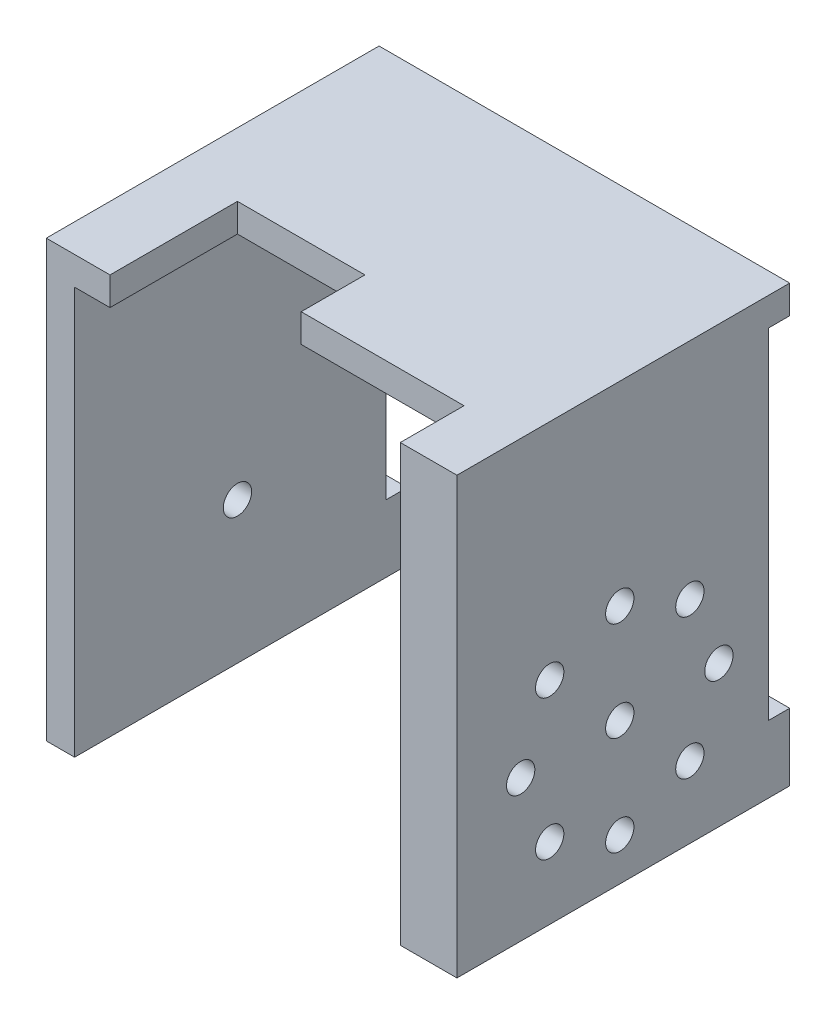
ISO-10303-21;
HEADER;
FILE_DESCRIPTION(('STEP AP214'),'2;1');
FILE_NAME('part.step','',(''),(''),'','','');
FILE_SCHEMA(('AUTOMOTIVE_DESIGN { 1 0 10303 214 1 1 1 1 }'));
ENDSEC;
DATA;
#1=APPLICATION_CONTEXT('core data for automotive mechanical design processes');
#2=APPLICATION_PROTOCOL_DEFINITION('international standard','automotive_design',2000,#1);
#3=PRODUCT_CONTEXT('',#1,'mechanical');
#4=PRODUCT('Part','Part','',(#3));
#5=PRODUCT_RELATED_PRODUCT_CATEGORY('part','',(#4));
#6=PRODUCT_DEFINITION_FORMATION('','',#4);
#7=PRODUCT_DEFINITION_CONTEXT('part definition',#1,'design');
#8=PRODUCT_DEFINITION('design','',#6,#7);
#9=PRODUCT_DEFINITION_SHAPE('','',#8);
#10=(LENGTH_UNIT() NAMED_UNIT(*) SI_UNIT(.MILLI.,.METRE.));
#11=(NAMED_UNIT(*) PLANE_ANGLE_UNIT() SI_UNIT($,.RADIAN.));
#12=(NAMED_UNIT(*) SI_UNIT($,.STERADIAN.) SOLID_ANGLE_UNIT());
#13=UNCERTAINTY_MEASURE_WITH_UNIT(LENGTH_MEASURE(1.E-05),#10,'distance_accuracy_value','');
#14=(GEOMETRIC_REPRESENTATION_CONTEXT(3) GLOBAL_UNCERTAINTY_ASSIGNED_CONTEXT((#13)) GLOBAL_UNIT_ASSIGNED_CONTEXT((#10,
#11,#12)) REPRESENTATION_CONTEXT('',''));
#15=CARTESIAN_POINT('',(0.,0.,0.));
#16=DIRECTION('',(0.,0.,1.));
#17=DIRECTION('',(1.,0.,0.));
#18=AXIS2_PLACEMENT_3D('',#15,#16,#17);
#19=CARTESIAN_POINT('',(46.,37.5,47.));
#20=DIRECTION('',(0.,0.,-1.));
#21=DIRECTION('',(-1.,0.,0.));
#22=AXIS2_PLACEMENT_3D('',#19,#20,#21);
#23=PLANE('',#22);
#24=DIRECTION('',(-1.,0.,0.));
#25=VECTOR('',#24,1.);
#26=CARTESIAN_POINT('',(-4.,41.5,47.));
#27=LINE('',#26,#25);
#28=CARTESIAN_POINT('',(54.,41.5,47.));
#29=VERTEX_POINT('',#28);
#30=CARTESIAN_POINT('',(46.0000000000002,41.5,47.));
#31=VERTEX_POINT('',#30);
#32=EDGE_CURVE('E311',#29,#31,#27,.T.);
#33=ORIENTED_EDGE('',*,*,#32,.T.);
#34=DIRECTION('',(0.,-1.,0.));
#35=VECTOR('',#34,1.);
#36=CARTESIAN_POINT('',(46.,37.5,47.));
#37=LINE('',#36,#35);
#38=CARTESIAN_POINT('',(46.0000000000002,-20.,47.));
#39=VERTEX_POINT('',#38);
#40=EDGE_CURVE('E304',#31,#39,#37,.T.);
#41=ORIENTED_EDGE('',*,*,#40,.T.);
#42=DIRECTION('',(1.,0.,0.));
#43=VECTOR('',#42,1.);
#44=CARTESIAN_POINT('',(46.0000000000002,-20.,47.));
#45=LINE('',#44,#43);
#46=CARTESIAN_POINT('',(54.0000000000002,-20.,47.));
#47=VERTEX_POINT('',#46);
#48=EDGE_CURVE('E307',#39,#47,#45,.T.);
#49=ORIENTED_EDGE('',*,*,#48,.T.);
#50=DIRECTION('',(0.,1.,0.));
#51=VECTOR('',#50,1.);
#52=CARTESIAN_POINT('',(54.,41.5,47.));
#53=LINE('',#52,#51);
#54=EDGE_CURVE('E309',#47,#29,#53,.T.);
#55=ORIENTED_EDGE('',*,*,#54,.T.);
#56=EDGE_LOOP('',(#33,#41,#49,#55));
#57=FACE_BOUND('',#56,.T.);
#58=ADVANCED_FACE('F30',(#57),#23,.F.);
#59=CARTESIAN_POINT('',(46.,37.5,0.));
#60=DIRECTION('',(0.,0.,-1.));
#61=DIRECTION('',(-1.,0.,0.));
#62=AXIS2_PLACEMENT_3D('',#59,#60,#61);
#63=PLANE('',#62);
#64=DIRECTION('',(1.,0.,0.));
#65=VECTOR('',#64,1.);
#66=CARTESIAN_POINT('',(-4.00000000000005,-10.5000000000002,0.));
#67=LINE('',#66,#65);
#68=CARTESIAN_POINT('',(-4.00000000000005,-10.5000000000002,0.));
#69=VERTEX_POINT('',#68);
#70=CARTESIAN_POINT('',(0.,-10.5000000000002,0.));
#71=VERTEX_POINT('',#70);
#72=EDGE_CURVE('E283',#69,#71,#67,.T.);
#73=ORIENTED_EDGE('',*,*,#72,.T.);
#74=DIRECTION('',(0.,1.,0.));
#75=VECTOR('',#74,1.);
#76=CARTESIAN_POINT('',(0.,-20.,0.));
#77=LINE('',#76,#75);
#78=CARTESIAN_POINT('',(0.,-20.,0.));
#79=VERTEX_POINT('',#78);
#80=EDGE_CURVE('E305',#79,#71,#77,.T.);
#81=ORIENTED_EDGE('',*,*,#80,.F.);
#82=DIRECTION('',(1.,0.,0.));
#83=VECTOR('',#82,1.);
#84=CARTESIAN_POINT('',(0.,-20.,0.));
#85=LINE('',#84,#83);
#86=CARTESIAN_POINT('',(-4.00000000000001,-20.,0.));
#87=VERTEX_POINT('',#86);
#88=EDGE_CURVE('E336',#87,#79,#85,.T.);
#89=ORIENTED_EDGE('',*,*,#88,.F.);
#90=DIRECTION('',(0.,-1.,0.));
#91=VECTOR('',#90,1.);
#92=CARTESIAN_POINT('',(-4.00000000000001,-20.,0.));
#93=LINE('',#92,#91);
#94=EDGE_CURVE('E332',#69,#87,#93,.T.);
#95=ORIENTED_EDGE('',*,*,#94,.F.);
#96=EDGE_LOOP('',(#73,#81,#89,#95));
#97=FACE_BOUND('',#96,.T.);
#98=ADVANCED_FACE('F422',(#97),#63,.T.);
#99=DIRECTION('',(-1.,0.,0.));
#100=VECTOR('',#99,1.);
#101=CARTESIAN_POINT('',(46.0000000000002,-10.5,0.));
#102=LINE('',#101,#100);
#103=CARTESIAN_POINT('',(54.0000000000002,-10.5,0.));
#104=VERTEX_POINT('',#103);
#105=CARTESIAN_POINT('',(46.0000000000001,-10.5,0.));
#106=VERTEX_POINT('',#105);
#107=EDGE_CURVE('E39',#104,#106,#102,.T.);
#108=ORIENTED_EDGE('',*,*,#107,.F.);
#109=DIRECTION('',(0.,1.,0.));
#110=VECTOR('',#109,1.);
#111=CARTESIAN_POINT('',(54.,41.5,0.));
#112=LINE('',#111,#110);
#113=CARTESIAN_POINT('',(54.0000000000002,-20.,0.));
#114=VERTEX_POINT('',#113);
#115=EDGE_CURVE('E327',#114,#104,#112,.T.);
#116=ORIENTED_EDGE('',*,*,#115,.F.);
#117=DIRECTION('',(1.,0.,0.));
#118=VECTOR('',#117,1.);
#119=CARTESIAN_POINT('',(46.0000000000002,-20.,0.));
#120=LINE('',#119,#118);
#121=CARTESIAN_POINT('',(46.0000000000002,-20.,0.));
#122=VERTEX_POINT('',#121);
#123=EDGE_CURVE('E324',#122,#114,#120,.T.);
#124=ORIENTED_EDGE('',*,*,#123,.F.);
#125=DIRECTION('',(0.,-1.,0.));
#126=VECTOR('',#125,1.);
#127=CARTESIAN_POINT('',(46.,37.5,0.));
#128=LINE('',#127,#126);
#129=EDGE_CURVE('E322',#106,#122,#128,.T.);
#130=ORIENTED_EDGE('',*,*,#129,.F.);
#131=EDGE_LOOP('',(#108,#116,#124,#130));
#132=FACE_BOUND('',#131,.T.);
#133=ADVANCED_FACE('F375',(#132),#63,.T.);
#134=CARTESIAN_POINT('',(0.,37.5,47.));
#135=DIRECTION('',(0.,1.,0.));
#136=DIRECTION('',(-1.,0.,0.));
#137=AXIS2_PLACEMENT_3D('',#134,#135,#136);
#138=PLANE('',#137);
#139=DIRECTION('',(0.,0.,-1.));
#140=VECTOR('',#139,1.);
#141=CARTESIAN_POINT('',(46.,37.5,47.));
#142=LINE('',#141,#140);
#143=CARTESIAN_POINT('',(46.,37.5,38.));
#144=VERTEX_POINT('',#143);
#145=CARTESIAN_POINT('',(46.,37.5,3.00000000000001));
#146=VERTEX_POINT('',#145);
#147=EDGE_CURVE('E360',#144,#146,#142,.T.);
#148=ORIENTED_EDGE('',*,*,#147,.F.);
#149=DIRECTION('',(1.,0.,0.));
#150=VECTOR('',#149,1.);
#151=CARTESIAN_POINT('',(23.,37.5,38.));
#152=LINE('',#151,#150);
#153=CARTESIAN_POINT('',(23.,37.5,38.));
#154=VERTEX_POINT('',#153);
#155=EDGE_CURVE('E185',#154,#144,#152,.T.);
#156=ORIENTED_EDGE('',*,*,#155,.F.);
#157=DIRECTION('',(0.,0.,1.));
#158=VECTOR('',#157,1.);
#159=CARTESIAN_POINT('',(23.,37.5,38.));
#160=LINE('',#159,#158);
#161=CARTESIAN_POINT('',(23.,37.5,29.));
#162=VERTEX_POINT('',#161);
#163=EDGE_CURVE('E188',#162,#154,#160,.T.);
#164=ORIENTED_EDGE('',*,*,#163,.F.);
#165=DIRECTION('',(1.,0.,0.));
#166=VECTOR('',#165,1.);
#167=CARTESIAN_POINT('',(5.00000000000004,37.5,29.));
#168=LINE('',#167,#166);
#169=CARTESIAN_POINT('',(5.00000000000004,37.5,29.));
#170=VERTEX_POINT('',#169);
#171=EDGE_CURVE('E198',#170,#162,#168,.T.);
#172=ORIENTED_EDGE('',*,*,#171,.F.);
#173=DIRECTION('',(0.,0.,-1.));
#174=VECTOR('',#173,1.);
#175=CARTESIAN_POINT('',(5.00000000000003,37.5,47.));
#176=LINE('',#175,#174);
#177=CARTESIAN_POINT('',(5.00000000000003,37.5,47.));
#178=VERTEX_POINT('',#177);
#179=EDGE_CURVE('E165',#178,#170,#176,.T.);
#180=ORIENTED_EDGE('',*,*,#179,.F.);
#181=DIRECTION('',(1.,0.,0.));
#182=VECTOR('',#181,1.);
#183=CARTESIAN_POINT('',(0.,37.5,47.));
#184=LINE('',#183,#182);
#185=CARTESIAN_POINT('',(0.,37.5,47.));
#186=VERTEX_POINT('',#185);
#187=EDGE_CURVE('E301',#186,#178,#184,.T.);
#188=ORIENTED_EDGE('',*,*,#187,.F.);
#189=DIRECTION('',(0.,0.,-1.));
#190=VECTOR('',#189,1.);
#191=CARTESIAN_POINT('',(0.,37.5,47.));
#192=LINE('',#191,#190);
#193=CARTESIAN_POINT('',(0.,37.4999999999998,3.00000000000001));
#194=VERTEX_POINT('',#193);
#195=EDGE_CURVE('E320',#186,#194,#192,.T.);
#196=ORIENTED_EDGE('',*,*,#195,.T.);
#197=DIRECTION('',(1.,0.,0.));
#198=VECTOR('',#197,1.);
#199=CARTESIAN_POINT('',(-4.00000000000021,37.4999999999998,3.00000000000001));
#200=LINE('',#199,#198);
#201=CARTESIAN_POINT('',(-4.00000000000021,37.4999999999998,3.00000000000001));
#202=VERTEX_POINT('',#201);
#203=EDGE_CURVE('E291',#202,#194,#200,.T.);
#204=ORIENTED_EDGE('',*,*,#203,.F.);
#205=DIRECTION('',(0.,0.,1.));
#206=VECTOR('',#205,1.);
#207=CARTESIAN_POINT('',(-4.00000000000021,37.4999999999998,0.));
#208=LINE('',#207,#206);
#209=CARTESIAN_POINT('',(-4.,37.4999999999998,0.));
#210=VERTEX_POINT('',#209);
#211=EDGE_CURVE('E266',#210,#202,#208,.T.);
#212=ORIENTED_EDGE('',*,*,#211,.F.);
#213=DIRECTION('',(1.,0.,0.));
#214=VECTOR('',#213,1.);
#215=CARTESIAN_POINT('',(0.,37.5,0.));
#216=LINE('',#215,#214);
#217=CARTESIAN_POINT('',(54.,37.5,0.));
#218=VERTEX_POINT('',#217);
#219=EDGE_CURVE('E54',#210,#218,#216,.T.);
#220=ORIENTED_EDGE('',*,*,#219,.T.);
#221=DIRECTION('',(0.,0.,1.));
#222=VECTOR('',#221,1.);
#223=CARTESIAN_POINT('',(54.,37.5,0.));
#224=LINE('',#223,#222);
#225=CARTESIAN_POINT('',(54.,37.5,3.00000000000001));
#226=VERTEX_POINT('',#225);
#227=EDGE_CURVE('E265',#218,#226,#224,.T.);
#228=ORIENTED_EDGE('',*,*,#227,.T.);
#229=EDGE_CURVE('E276',#146,#226,#200,.T.);
#230=ORIENTED_EDGE('',*,*,#229,.F.);
#231=EDGE_LOOP('',(#148,#156,#164,#172,#180,#188,#196,#204,#212,#220,#228,#230));
#232=FACE_BOUND('',#231,.T.);
#233=ADVANCED_FACE('F32',(#232),#138,.F.);
#234=CARTESIAN_POINT('',(46.,37.5,47.));
#235=DIRECTION('',(1.,0.,0.));
#236=DIRECTION('',(0.,1.,0.));
#237=AXIS2_PLACEMENT_3D('',#234,#235,#236);
#238=PLANE('',#237);
#239=CARTESIAN_POINT('',(46.0000000000001,9.89949493661152,33.899494936612));
#240=DIRECTION('',(1.,0.,0.));
#241=DIRECTION('',(0.,1.,0.));
#242=AXIS2_PLACEMENT_3D('',#239,#240,#241);
#243=CIRCLE('',#242,2.00000000000028);
#244=CARTESIAN_POINT('',(46.0000000000001,11.8994949366118,33.899494936612));
#245=VERTEX_POINT('',#244);
#246=EDGE_CURVE('E209',#245,#245,#243,.F.);
#247=ORIENTED_EDGE('',*,*,#246,.F.);
#248=EDGE_LOOP('',(#247));
#249=FACE_BOUND('',#248,.T.);
#250=CARTESIAN_POINT('',(46.0000000000001,-1.07975958797385E-13,37.9999999999998));
#251=DIRECTION('',(1.,0.,0.));
#252=DIRECTION('',(0.,1.,0.));
#253=AXIS2_PLACEMENT_3D('',#250,#251,#252);
#254=CIRCLE('',#253,2.);
#255=CARTESIAN_POINT('',(46.0000000000001,1.99999999999989,37.9999999999998));
#256=VERTEX_POINT('',#255);
#257=EDGE_CURVE('E215',#256,#256,#254,.F.);
#258=ORIENTED_EDGE('',*,*,#257,.F.);
#259=EDGE_LOOP('',(#258));
#260=FACE_BOUND('',#259,.T.);
#261=CARTESIAN_POINT('',(46.0000000000002,-9.89949493661177,33.8994949366114));
#262=DIRECTION('',(1.,0.,0.));
#263=DIRECTION('',(0.,1.,0.));
#264=AXIS2_PLACEMENT_3D('',#261,#262,#263);
#265=CIRCLE('',#264,2.);
#266=CARTESIAN_POINT('',(46.0000000000002,-7.89949493661177,33.8994949366114));
#267=VERTEX_POINT('',#266);
#268=EDGE_CURVE('E221',#267,#267,#265,.F.);
#269=ORIENTED_EDGE('',*,*,#268,.F.);
#270=EDGE_LOOP('',(#269));
#271=FACE_BOUND('',#270,.T.);
#272=CARTESIAN_POINT('',(46.0000000000002,-14.0000000000001,23.9999999999997));
#273=DIRECTION('',(1.,0.,0.));
#274=DIRECTION('',(0.,1.,0.));
#275=AXIS2_PLACEMENT_3D('',#272,#273,#274);
#276=CIRCLE('',#275,2.);
#277=CARTESIAN_POINT('',(46.0000000000002,-12.0000000000001,23.9999999999997));
#278=VERTEX_POINT('',#277);
#279=EDGE_CURVE('E227',#278,#278,#276,.F.);
#280=ORIENTED_EDGE('',*,*,#279,.F.);
#281=EDGE_LOOP('',(#280));
#282=FACE_BOUND('',#281,.T.);
#283=CARTESIAN_POINT('',(46.0000000000002,-9.89949493661163,14.1005050633881));
#284=DIRECTION('',(1.,0.,0.));
#285=DIRECTION('',(0.,1.,0.));
#286=AXIS2_PLACEMENT_3D('',#283,#284,#285);
#287=CIRCLE('',#286,2.);
#288=CARTESIAN_POINT('',(46.0000000000002,-7.89949493661163,14.1005050633881));
#289=VERTEX_POINT('',#288);
#290=EDGE_CURVE('E233',#289,#289,#287,.F.);
#291=ORIENTED_EDGE('',*,*,#290,.F.);
#292=EDGE_LOOP('',(#291));
#293=FACE_BOUND('',#292,.T.);
#294=CARTESIAN_POINT('',(46.0000000000001,0.,9.9999999999998));
#295=DIRECTION('',(1.,0.,0.));
#296=DIRECTION('',(0.,1.,0.));
#297=AXIS2_PLACEMENT_3D('',#294,#295,#296);
#298=CIRCLE('',#297,2.);
#299=CARTESIAN_POINT('',(46.0000000000001,2.0000000000001,9.9999999999998));
#300=VERTEX_POINT('',#299);
#301=EDGE_CURVE('E239',#300,#300,#298,.F.);
#302=ORIENTED_EDGE('',*,*,#301,.F.);
#303=EDGE_LOOP('',(#302));
#304=FACE_BOUND('',#303,.T.);
#305=CARTESIAN_POINT('',(46.0000000000001,9.89949493661173,14.1005050633883));
#306=DIRECTION('',(1.,0.,0.));
#307=DIRECTION('',(0.,1.,0.));
#308=AXIS2_PLACEMENT_3D('',#305,#306,#307);
#309=CIRCLE('',#308,2.);
#310=CARTESIAN_POINT('',(46.0000000000001,11.8994949366117,14.1005050633883));
#311=VERTEX_POINT('',#310);
#312=EDGE_CURVE('E245',#311,#311,#309,.F.);
#313=ORIENTED_EDGE('',*,*,#312,.F.);
#314=EDGE_LOOP('',(#313));
#315=FACE_BOUND('',#314,.T.);
#316=CARTESIAN_POINT('',(46.0000000000001,13.9999999999999,24.));
#317=DIRECTION('',(1.,0.,0.));
#318=DIRECTION('',(0.,1.,0.));
#319=AXIS2_PLACEMENT_3D('',#316,#317,#318);
#320=CIRCLE('',#319,2.);
#321=CARTESIAN_POINT('',(46.0000000000001,15.9999999999999,24.));
#322=VERTEX_POINT('',#321);
#323=EDGE_CURVE('E251',#322,#322,#320,.F.);
#324=ORIENTED_EDGE('',*,*,#323,.F.);
#325=EDGE_LOOP('',(#324));
#326=FACE_BOUND('',#325,.T.);
#327=CARTESIAN_POINT('',(46.0000000000001,0.,24.));
#328=DIRECTION('',(1.,0.,0.));
#329=DIRECTION('',(0.,1.,0.));
#330=AXIS2_PLACEMENT_3D('',#327,#328,#329);
#331=CIRCLE('',#330,2.);
#332=CARTESIAN_POINT('',(46.0000000000001,1.99999999999994,24.));
#333=VERTEX_POINT('',#332);
#334=EDGE_CURVE('E262',#333,#333,#331,.T.);
#335=ORIENTED_EDGE('',*,*,#334,.T.);
#336=EDGE_LOOP('',(#335));
#337=FACE_BOUND('',#336,.T.);
#338=DIRECTION('',(0.,-1.,0.));
#339=VECTOR('',#338,1.);
#340=CARTESIAN_POINT('',(46.,37.5,3.));
#341=LINE('',#340,#339);
#342=CARTESIAN_POINT('',(46.0000000000001,-10.5,3.));
#343=VERTEX_POINT('',#342);
#344=EDGE_CURVE('E298',#146,#343,#341,.T.);
#345=ORIENTED_EDGE('',*,*,#344,.T.);
#346=DIRECTION('',(0.,0.,-1.));
#347=VECTOR('',#346,1.);
#348=CARTESIAN_POINT('',(46.0000000000002,-10.5,47.));
#349=LINE('',#348,#347);
#350=EDGE_CURVE('E295',#343,#106,#349,.T.);
#351=ORIENTED_EDGE('',*,*,#350,.T.);
#352=ORIENTED_EDGE('',*,*,#129,.T.);
#353=DIRECTION('',(0.,0.,-1.));
#354=VECTOR('',#353,1.);
#355=CARTESIAN_POINT('',(46.0000000000002,-20.,47.));
#356=LINE('',#355,#354);
#357=EDGE_CURVE('E357',#39,#122,#356,.T.);
#358=ORIENTED_EDGE('',*,*,#357,.F.);
#359=ORIENTED_EDGE('',*,*,#40,.F.);
#360=DIRECTION('',(0.,0.,1.));
#361=VECTOR('',#360,1.);
#362=CARTESIAN_POINT('',(46.,41.5,38.));
#363=LINE('',#362,#361);
#364=CARTESIAN_POINT('',(46.,41.5,38.));
#365=VERTEX_POINT('',#364);
#366=EDGE_CURVE('E194',#365,#31,#363,.T.);
#367=ORIENTED_EDGE('',*,*,#366,.F.);
#368=DIRECTION('',(0.,-1.,0.));
#369=VECTOR('',#368,1.);
#370=CARTESIAN_POINT('',(46.,41.5,38.));
#371=LINE('',#370,#369);
#372=EDGE_CURVE('E202',#365,#144,#371,.T.);
#373=ORIENTED_EDGE('',*,*,#372,.T.);
#374=ORIENTED_EDGE('',*,*,#147,.T.);
#375=EDGE_LOOP('',(#345,#351,#352,#358,#359,#367,#373,#374));
#376=FACE_BOUND('',#375,.T.);
#377=ADVANCED_FACE('F371',(#249,#260,#271,#282,#293,#304,#315,#326,#337,#376),#238,.F.);
#378=CARTESIAN_POINT('',(46.0000000000002,-20.,47.));
#379=DIRECTION('',(0.,1.,0.));
#380=DIRECTION('',(-1.,0.,0.));
#381=AXIS2_PLACEMENT_3D('',#378,#379,#380);
#382=PLANE('',#381);
#383=ORIENTED_EDGE('',*,*,#123,.T.);
#384=DIRECTION('',(0.,0.,-1.));
#385=VECTOR('',#384,1.);
#386=CARTESIAN_POINT('',(54.0000000000002,-20.,47.));
#387=LINE('',#386,#385);
#388=EDGE_CURVE('E354',#47,#114,#387,.T.);
#389=ORIENTED_EDGE('',*,*,#388,.F.);
#390=ORIENTED_EDGE('',*,*,#48,.F.);
#391=ORIENTED_EDGE('',*,*,#357,.T.);
#392=EDGE_LOOP('',(#383,#389,#390,#391));
#393=FACE_BOUND('',#392,.T.);
#394=ADVANCED_FACE('F378',(#393),#382,.F.);
#395=CARTESIAN_POINT('',(54.,41.5,47.));
#396=DIRECTION('',(-1.,0.,0.));
#397=DIRECTION('',(0.,-1.,0.));
#398=AXIS2_PLACEMENT_3D('',#395,#396,#397);
#399=PLANE('',#398);
#400=CARTESIAN_POINT('',(54.0000000000001,9.89949493661154,33.899494936612));
#401=DIRECTION('',(1.,0.,0.));
#402=DIRECTION('',(0.,1.,0.));
#403=AXIS2_PLACEMENT_3D('',#400,#401,#402);
#404=CIRCLE('',#403,2.00000000000028);
#405=CARTESIAN_POINT('',(54.0000000000001,11.8994949366118,33.899494936612));
#406=VERTEX_POINT('',#405);
#407=EDGE_CURVE('E204',#406,#406,#404,.T.);
#408=ORIENTED_EDGE('',*,*,#407,.F.);
#409=EDGE_LOOP('',(#408));
#410=FACE_BOUND('',#409,.T.);
#411=CARTESIAN_POINT('',(54.0000000000001,0.,37.9999999999998));
#412=DIRECTION('',(1.,0.,0.));
#413=DIRECTION('',(0.,1.,0.));
#414=AXIS2_PLACEMENT_3D('',#411,#412,#413);
#415=CIRCLE('',#414,2.);
#416=CARTESIAN_POINT('',(54.0000000000001,1.99999999999992,37.9999999999998));
#417=VERTEX_POINT('',#416);
#418=EDGE_CURVE('E212',#417,#417,#415,.T.);
#419=ORIENTED_EDGE('',*,*,#418,.F.);
#420=EDGE_LOOP('',(#419));
#421=FACE_BOUND('',#420,.T.);
#422=CARTESIAN_POINT('',(54.0000000000002,-9.89949493661175,33.8994949366114));
#423=DIRECTION('',(1.,0.,0.));
#424=DIRECTION('',(0.,1.,0.));
#425=AXIS2_PLACEMENT_3D('',#422,#423,#424);
#426=CIRCLE('',#425,2.);
#427=CARTESIAN_POINT('',(54.0000000000002,-7.89949493661174,33.8994949366114));
#428=VERTEX_POINT('',#427);
#429=EDGE_CURVE('E218',#428,#428,#426,.T.);
#430=ORIENTED_EDGE('',*,*,#429,.F.);
#431=EDGE_LOOP('',(#430));
#432=FACE_BOUND('',#431,.T.);
#433=CARTESIAN_POINT('',(54.0000000000002,-14.,23.9999999999997));
#434=DIRECTION('',(1.,0.,0.));
#435=DIRECTION('',(0.,1.,0.));
#436=AXIS2_PLACEMENT_3D('',#433,#434,#435);
#437=CIRCLE('',#436,2.);
#438=CARTESIAN_POINT('',(54.0000000000002,-12.,23.9999999999997));
#439=VERTEX_POINT('',#438);
#440=EDGE_CURVE('E224',#439,#439,#437,.T.);
#441=ORIENTED_EDGE('',*,*,#440,.F.);
#442=EDGE_LOOP('',(#441));
#443=FACE_BOUND('',#442,.T.);
#444=CARTESIAN_POINT('',(54.0000000000002,-9.89949493661161,14.1005050633881));
#445=DIRECTION('',(1.,0.,0.));
#446=DIRECTION('',(0.,1.,0.));
#447=AXIS2_PLACEMENT_3D('',#444,#445,#446);
#448=CIRCLE('',#447,2.);
#449=CARTESIAN_POINT('',(54.0000000000002,-7.8994949366116,14.1005050633881));
#450=VERTEX_POINT('',#449);
#451=EDGE_CURVE('E230',#450,#450,#448,.T.);
#452=ORIENTED_EDGE('',*,*,#451,.F.);
#453=EDGE_LOOP('',(#452));
#454=FACE_BOUND('',#453,.T.);
#455=CARTESIAN_POINT('',(54.0000000000001,1.20330574772636E-13,9.9999999999998));
#456=DIRECTION('',(1.,0.,0.));
#457=DIRECTION('',(0.,1.,0.));
#458=AXIS2_PLACEMENT_3D('',#455,#456,#457);
#459=CIRCLE('',#458,2.);
#460=CARTESIAN_POINT('',(54.0000000000001,2.00000000000012,9.9999999999998));
#461=VERTEX_POINT('',#460);
#462=EDGE_CURVE('E236',#461,#461,#459,.T.);
#463=ORIENTED_EDGE('',*,*,#462,.F.);
#464=EDGE_LOOP('',(#463));
#465=FACE_BOUND('',#464,.T.);
#466=CARTESIAN_POINT('',(54.0000000000001,9.89949493661176,14.1005050633883));
#467=DIRECTION('',(1.,0.,0.));
#468=DIRECTION('',(0.,1.,0.));
#469=AXIS2_PLACEMENT_3D('',#466,#467,#468);
#470=CIRCLE('',#469,2.);
#471=CARTESIAN_POINT('',(54.0000000000001,11.8994949366118,14.1005050633883));
#472=VERTEX_POINT('',#471);
#473=EDGE_CURVE('E242',#472,#472,#470,.T.);
#474=ORIENTED_EDGE('',*,*,#473,.F.);
#475=EDGE_LOOP('',(#474));
#476=FACE_BOUND('',#475,.T.);
#477=CARTESIAN_POINT('',(54.0000000000001,14.,24.));
#478=DIRECTION('',(1.,0.,0.));
#479=DIRECTION('',(0.,1.,0.));
#480=AXIS2_PLACEMENT_3D('',#477,#478,#479);
#481=CIRCLE('',#480,2.);
#482=CARTESIAN_POINT('',(54.0000000000001,16.,24.));
#483=VERTEX_POINT('',#482);
#484=EDGE_CURVE('E248',#483,#483,#481,.T.);
#485=ORIENTED_EDGE('',*,*,#484,.F.);
#486=EDGE_LOOP('',(#485));
#487=FACE_BOUND('',#486,.T.);
#488=CARTESIAN_POINT('',(54.0000000000001,0.,24.));
#489=DIRECTION('',(1.,0.,0.));
#490=DIRECTION('',(0.,1.,0.));
#491=AXIS2_PLACEMENT_3D('',#488,#489,#490);
#492=CIRCLE('',#491,2.);
#493=CARTESIAN_POINT('',(54.0000000000001,1.99999999999997,24.));
#494=VERTEX_POINT('',#493);
#495=EDGE_CURVE('E254',#494,#494,#492,.T.);
#496=ORIENTED_EDGE('',*,*,#495,.F.);
#497=EDGE_LOOP('',(#496));
#498=FACE_BOUND('',#497,.T.);
#499=ORIENTED_EDGE('',*,*,#115,.T.);
#500=DIRECTION('',(0.,0.,-1.));
#501=VECTOR('',#500,1.);
#502=CARTESIAN_POINT('',(54.0000000000002,-10.5,3.));
#503=LINE('',#502,#501);
#504=CARTESIAN_POINT('',(54.0000000000002,-10.5,3.));
#505=VERTEX_POINT('',#504);
#506=EDGE_CURVE('E270',#505,#104,#503,.T.);
#507=ORIENTED_EDGE('',*,*,#506,.F.);
#508=DIRECTION('',(0.,-1.,0.));
#509=VECTOR('',#508,1.);
#510=CARTESIAN_POINT('',(54.,37.5,3.00000000000001));
#511=LINE('',#510,#509);
#512=EDGE_CURVE('E279',#226,#505,#511,.T.);
#513=ORIENTED_EDGE('',*,*,#512,.F.);
#514=ORIENTED_EDGE('',*,*,#227,.F.);
#515=CARTESIAN_POINT('',(54.,41.5,0.));
#516=VERTEX_POINT('',#515);
#517=EDGE_CURVE('E326',#218,#516,#112,.T.);
#518=ORIENTED_EDGE('',*,*,#517,.T.);
#519=DIRECTION('',(0.,0.,-1.));
#520=VECTOR('',#519,1.);
#521=CARTESIAN_POINT('',(54.,41.5,47.));
#522=LINE('',#521,#520);
#523=EDGE_CURVE('E351',#29,#516,#522,.T.);
#524=ORIENTED_EDGE('',*,*,#523,.F.);
#525=ORIENTED_EDGE('',*,*,#54,.F.);
#526=ORIENTED_EDGE('',*,*,#388,.T.);
#527=EDGE_LOOP('',(#499,#507,#513,#514,#518,#524,#525,#526));
#528=FACE_BOUND('',#527,.T.);
#529=ADVANCED_FACE('F382',(#410,#421,#432,#443,#454,#465,#476,#487,#498,#528),#399,.F.);
#530=CARTESIAN_POINT('',(-4.,41.5,47.));
#531=DIRECTION('',(0.,-1.,0.));
#532=DIRECTION('',(0.,0.,-1.));
#533=AXIS2_PLACEMENT_3D('',#530,#531,#532);
#534=PLANE('',#533);
#535=DIRECTION('',(1.,0.,0.));
#536=VECTOR('',#535,1.);
#537=CARTESIAN_POINT('',(23.,41.5,38.));
#538=LINE('',#537,#536);
#539=CARTESIAN_POINT('',(23.,41.5,38.));
#540=VERTEX_POINT('',#539);
#541=EDGE_CURVE('E192',#540,#365,#538,.T.);
#542=ORIENTED_EDGE('',*,*,#541,.T.);
#543=ORIENTED_EDGE('',*,*,#366,.T.);
#544=ORIENTED_EDGE('',*,*,#32,.F.);
#545=ORIENTED_EDGE('',*,*,#523,.T.);
#546=DIRECTION('',(-1.,0.,0.));
#547=VECTOR('',#546,1.);
#548=CARTESIAN_POINT('',(-4.,41.5,0.));
#549=LINE('',#548,#547);
#550=CARTESIAN_POINT('',(-4.,41.5,0.));
#551=VERTEX_POINT('',#550);
#552=EDGE_CURVE('E330',#516,#551,#549,.T.);
#553=ORIENTED_EDGE('',*,*,#552,.T.);
#554=DIRECTION('',(0.,0.,-1.));
#555=VECTOR('',#554,1.);
#556=CARTESIAN_POINT('',(-4.,41.5,47.));
#557=LINE('',#556,#555);
#558=CARTESIAN_POINT('',(-4.,41.5,47.));
#559=VERTEX_POINT('',#558);
#560=EDGE_CURVE('E348',#559,#551,#557,.T.);
#561=ORIENTED_EDGE('',*,*,#560,.F.);
#562=CARTESIAN_POINT('',(5.00000000000004,41.5,47.));
#563=VERTEX_POINT('',#562);
#564=EDGE_CURVE('E184',#563,#559,#27,.T.);
#565=ORIENTED_EDGE('',*,*,#564,.F.);
#566=DIRECTION('',(0.,0.,-1.));
#567=VECTOR('',#566,1.);
#568=CARTESIAN_POINT('',(5.00000000000004,41.5,47.));
#569=LINE('',#568,#567);
#570=CARTESIAN_POINT('',(5.00000000000004,41.5,29.));
#571=VERTEX_POINT('',#570);
#572=EDGE_CURVE('E46',#563,#571,#569,.T.);
#573=ORIENTED_EDGE('',*,*,#572,.T.);
#574=DIRECTION('',(1.,0.,0.));
#575=VECTOR('',#574,1.);
#576=CARTESIAN_POINT('',(5.00000000000004,41.5,29.));
#577=LINE('',#576,#575);
#578=CARTESIAN_POINT('',(23.,41.5,29.));
#579=VERTEX_POINT('',#578);
#580=EDGE_CURVE('E173',#571,#579,#577,.T.);
#581=ORIENTED_EDGE('',*,*,#580,.T.);
#582=DIRECTION('',(0.,0.,1.));
#583=VECTOR('',#582,1.);
#584=CARTESIAN_POINT('',(23.,41.5,38.));
#585=LINE('',#584,#583);
#586=EDGE_CURVE('E178',#579,#540,#585,.T.);
#587=ORIENTED_EDGE('',*,*,#586,.T.);
#588=EDGE_LOOP('',(#542,#543,#544,#545,#553,#561,#565,#573,#581,#587));
#589=FACE_BOUND('',#588,.T.);
#590=ADVANCED_FACE('F182',(#589),#534,.F.);
#591=CARTESIAN_POINT('',(-4.00000000000001,-20.,47.));
#592=DIRECTION('',(1.,0.,0.));
#593=DIRECTION('',(0.,1.,0.));
#594=AXIS2_PLACEMENT_3D('',#591,#592,#593);
#595=PLANE('',#594);
#596=CARTESIAN_POINT('',(-4.00000000000008,-2.27653745641779E-13,24.));
#597=DIRECTION('',(1.,0.,0.));
#598=DIRECTION('',(0.,1.,0.));
#599=AXIS2_PLACEMENT_3D('',#596,#597,#598);
#600=CIRCLE('',#599,2.);
#601=CARTESIAN_POINT('',(-4.00000000000009,1.99999999999978,24.));
#602=VERTEX_POINT('',#601);
#603=EDGE_CURVE('E257',#602,#602,#600,.T.);
#604=ORIENTED_EDGE('',*,*,#603,.T.);
#605=EDGE_LOOP('',(#604));
#606=FACE_BOUND('',#605,.T.);
#607=DIRECTION('',(0.,-1.,0.));
#608=VECTOR('',#607,1.);
#609=CARTESIAN_POINT('',(-4.00000000000021,37.4999999999998,3.00000000000001));
#610=LINE('',#609,#608);
#611=CARTESIAN_POINT('',(-4.00000000000005,-10.5000000000002,3.));
#612=VERTEX_POINT('',#611);
#613=EDGE_CURVE('E269',#202,#612,#610,.T.);
#614=ORIENTED_EDGE('',*,*,#613,.T.);
#615=DIRECTION('',(0.,0.,-1.));
#616=VECTOR('',#615,1.);
#617=CARTESIAN_POINT('',(-4.00000000000005,-10.5000000000002,3.));
#618=LINE('',#617,#616);
#619=EDGE_CURVE('E273',#612,#69,#618,.T.);
#620=ORIENTED_EDGE('',*,*,#619,.T.);
#621=ORIENTED_EDGE('',*,*,#94,.T.);
#622=DIRECTION('',(0.,0.,-1.));
#623=VECTOR('',#622,1.);
#624=CARTESIAN_POINT('',(-4.00000000000001,-20.,47.));
#625=LINE('',#624,#623);
#626=CARTESIAN_POINT('',(-4.00000000000001,-20.,47.));
#627=VERTEX_POINT('',#626);
#628=EDGE_CURVE('E345',#627,#87,#625,.T.);
#629=ORIENTED_EDGE('',*,*,#628,.F.);
#630=DIRECTION('',(0.,-1.,0.));
#631=VECTOR('',#630,1.);
#632=CARTESIAN_POINT('',(-4.00000000000001,-20.,47.));
#633=LINE('',#632,#631);
#634=EDGE_CURVE('E314',#559,#627,#633,.T.);
#635=ORIENTED_EDGE('',*,*,#634,.F.);
#636=ORIENTED_EDGE('',*,*,#560,.T.);
#637=EDGE_CURVE('E333',#551,#210,#93,.T.);
#638=ORIENTED_EDGE('',*,*,#637,.T.);
#639=ORIENTED_EDGE('',*,*,#211,.T.);
#640=EDGE_LOOP('',(#614,#620,#621,#629,#635,#636,#638,#639));
#641=FACE_BOUND('',#640,.T.);
#642=ADVANCED_FACE('F402',(#606,#641),#595,.F.);
#643=CARTESIAN_POINT('',(0.,-20.,47.));
#644=DIRECTION('',(0.,1.,0.));
#645=DIRECTION('',(-1.,0.,0.));
#646=AXIS2_PLACEMENT_3D('',#643,#644,#645);
#647=PLANE('',#646);
#648=ORIENTED_EDGE('',*,*,#88,.T.);
#649=DIRECTION('',(0.,0.,-1.));
#650=VECTOR('',#649,1.);
#651=CARTESIAN_POINT('',(0.,-20.,47.));
#652=LINE('',#651,#650);
#653=CARTESIAN_POINT('',(0.,-20.,47.));
#654=VERTEX_POINT('',#653);
#655=EDGE_CURVE('E342',#654,#79,#652,.T.);
#656=ORIENTED_EDGE('',*,*,#655,.F.);
#657=DIRECTION('',(1.,0.,0.));
#658=VECTOR('',#657,1.);
#659=CARTESIAN_POINT('',(0.,-20.,47.));
#660=LINE('',#659,#658);
#661=EDGE_CURVE('E316',#627,#654,#660,.T.);
#662=ORIENTED_EDGE('',*,*,#661,.F.);
#663=ORIENTED_EDGE('',*,*,#628,.T.);
#664=EDGE_LOOP('',(#648,#656,#662,#663));
#665=FACE_BOUND('',#664,.T.);
#666=ADVANCED_FACE('F436',(#665),#647,.F.);
#667=CARTESIAN_POINT('',(0.,-20.,47.));
#668=DIRECTION('',(-1.,0.,0.));
#669=DIRECTION('',(0.,0.,1.));
#670=AXIS2_PLACEMENT_3D('',#667,#668,#669);
#671=PLANE('',#670);
#672=CARTESIAN_POINT('',(0.,-2.14114440463423E-13,24.));
#673=DIRECTION('',(-1.,0.,0.));
#674=DIRECTION('',(0.,0.,1.));
#675=AXIS2_PLACEMENT_3D('',#672,#673,#674);
#676=CIRCLE('',#675,2.);
#677=CARTESIAN_POINT('',(0.,-2.14114440463423E-13,26.));
#678=VERTEX_POINT('',#677);
#679=EDGE_CURVE('E34',#678,#678,#676,.T.);
#680=ORIENTED_EDGE('',*,*,#679,.T.);
#681=EDGE_LOOP('',(#680));
#682=FACE_BOUND('',#681,.T.);
#683=ORIENTED_EDGE('',*,*,#80,.T.);
#684=DIRECTION('',(0.,0.,1.));
#685=VECTOR('',#684,1.);
#686=CARTESIAN_POINT('',(0.,-10.5000000000002,47.));
#687=LINE('',#686,#685);
#688=CARTESIAN_POINT('',(0.,-10.5000000000002,3.));
#689=VERTEX_POINT('',#688);
#690=EDGE_CURVE('E286',#71,#689,#687,.T.);
#691=ORIENTED_EDGE('',*,*,#690,.T.);
#692=DIRECTION('',(0.,1.,0.));
#693=VECTOR('',#692,1.);
#694=CARTESIAN_POINT('',(0.,-20.,3.));
#695=LINE('',#694,#693);
#696=EDGE_CURVE('E11',#689,#194,#695,.T.);
#697=ORIENTED_EDGE('',*,*,#696,.T.);
#698=ORIENTED_EDGE('',*,*,#195,.F.);
#699=DIRECTION('',(0.,1.,0.));
#700=VECTOR('',#699,1.);
#701=CARTESIAN_POINT('',(0.,-20.,47.));
#702=LINE('',#701,#700);
#703=EDGE_CURVE('E318',#654,#186,#702,.T.);
#704=ORIENTED_EDGE('',*,*,#703,.F.);
#705=ORIENTED_EDGE('',*,*,#655,.T.);
#706=EDGE_LOOP('',(#683,#691,#697,#698,#704,#705));
#707=FACE_BOUND('',#706,.T.);
#708=ADVANCED_FACE('F431',(#682,#707),#671,.F.);
#709=ORIENTED_EDGE('',*,*,#187,.T.);
#710=DIRECTION('',(0.,-1.,0.));
#711=VECTOR('',#710,1.);
#712=CARTESIAN_POINT('',(5.00000000000004,41.5,47.));
#713=LINE('',#712,#711);
#714=EDGE_CURVE('E170',#563,#178,#713,.T.);
#715=ORIENTED_EDGE('',*,*,#714,.F.);
#716=ORIENTED_EDGE('',*,*,#564,.T.);
#717=ORIENTED_EDGE('',*,*,#634,.T.);
#718=ORIENTED_EDGE('',*,*,#661,.T.);
#719=ORIENTED_EDGE('',*,*,#703,.T.);
#720=EDGE_LOOP('',(#709,#715,#716,#717,#718,#719));
#721=FACE_BOUND('',#720,.T.);
#722=ADVANCED_FACE('F406',(#721),#23,.F.);
#723=ORIENTED_EDGE('',*,*,#219,.F.);
#724=ORIENTED_EDGE('',*,*,#637,.F.);
#725=ORIENTED_EDGE('',*,*,#552,.F.);
#726=ORIENTED_EDGE('',*,*,#517,.F.);
#727=EDGE_LOOP('',(#723,#724,#725,#726));
#728=FACE_BOUND('',#727,.T.);
#729=ADVANCED_FACE('F399',(#728),#63,.T.);
#730=CARTESIAN_POINT('',(-4.00000000000005,-10.5000000000002,3.));
#731=DIRECTION('',(0.,-1.,0.));
#732=DIRECTION('',(1.,0.,0.));
#733=AXIS2_PLACEMENT_3D('',#730,#731,#732);
#734=PLANE('',#733);
#735=DIRECTION('',(1.,0.,0.));
#736=VECTOR('',#735,1.);
#737=CARTESIAN_POINT('',(-4.00000000000005,-10.5000000000002,3.));
#738=LINE('',#737,#736);
#739=EDGE_CURVE('E290',#343,#505,#738,.T.);
#740=ORIENTED_EDGE('',*,*,#739,.T.);
#741=ORIENTED_EDGE('',*,*,#506,.T.);
#742=ORIENTED_EDGE('',*,*,#107,.T.);
#743=ORIENTED_EDGE('',*,*,#350,.F.);
#744=EDGE_LOOP('',(#740,#741,#742,#743));
#745=FACE_BOUND('',#744,.T.);
#746=ADVANCED_FACE('F364',(#745),#734,.F.);
#747=CARTESIAN_POINT('',(-4.00000000000021,37.4999999999998,3.00000000000001));
#748=DIRECTION('',(0.,0.,1.));
#749=DIRECTION('',(0.,-1.,0.));
#750=AXIS2_PLACEMENT_3D('',#747,#748,#749);
#751=PLANE('',#750);
#752=ORIENTED_EDGE('',*,*,#229,.T.);
#753=ORIENTED_EDGE('',*,*,#512,.T.);
#754=ORIENTED_EDGE('',*,*,#739,.F.);
#755=ORIENTED_EDGE('',*,*,#344,.F.);
#756=EDGE_LOOP('',(#752,#753,#754,#755));
#757=FACE_BOUND('',#756,.T.);
#758=ADVANCED_FACE('F395',(#757),#751,.F.);
#759=EDGE_CURVE('E287',#612,#689,#738,.T.);
#760=ORIENTED_EDGE('',*,*,#759,.F.);
#761=ORIENTED_EDGE('',*,*,#613,.F.);
#762=ORIENTED_EDGE('',*,*,#203,.T.);
#763=ORIENTED_EDGE('',*,*,#696,.F.);
#764=EDGE_LOOP('',(#760,#761,#762,#763));
#765=FACE_BOUND('',#764,.T.);
#766=ADVANCED_FACE('F498',(#765),#751,.F.);
#767=ORIENTED_EDGE('',*,*,#72,.F.);
#768=ORIENTED_EDGE('',*,*,#619,.F.);
#769=ORIENTED_EDGE('',*,*,#759,.T.);
#770=ORIENTED_EDGE('',*,*,#690,.F.);
#771=EDGE_LOOP('',(#767,#768,#769,#770));
#772=FACE_BOUND('',#771,.T.);
#773=ADVANCED_FACE('F492',(#772),#734,.F.);
#774=CARTESIAN_POINT('',(-4.00000000000008,-2.27653745641779E-13,24.));
#775=DIRECTION('',(1.,0.,0.));
#776=DIRECTION('',(0.,1.,0.));
#777=AXIS2_PLACEMENT_3D('',#774,#775,#776);
#778=CYLINDRICAL_SURFACE('',#777,2.);
#779=ORIENTED_EDGE('',*,*,#603,.F.);
#780=EDGE_LOOP('',(#779));
#781=FACE_BOUND('',#780,.T.);
#782=ORIENTED_EDGE('',*,*,#679,.F.);
#783=EDGE_LOOP('',(#782));
#784=FACE_BOUND('',#783,.T.);
#785=ADVANCED_FACE('F482',(#781,#784),#778,.F.);
#786=ORIENTED_EDGE('',*,*,#495,.T.);
#787=EDGE_LOOP('',(#786));
#788=FACE_BOUND('',#787,.T.);
#789=ORIENTED_EDGE('',*,*,#334,.F.);
#790=EDGE_LOOP('',(#789));
#791=FACE_BOUND('',#790,.T.);
#792=ADVANCED_FACE('F479',(#788,#791),#778,.F.);
#793=CARTESIAN_POINT('',(-4.00100000000032,13.9999999999998,24.));
#794=DIRECTION('',(1.,0.,0.));
#795=DIRECTION('',(0.,1.,0.));
#796=AXIS2_PLACEMENT_3D('',#793,#794,#795);
#797=CYLINDRICAL_SURFACE('',#796,2.);
#798=ORIENTED_EDGE('',*,*,#484,.T.);
#799=EDGE_LOOP('',(#798));
#800=FACE_BOUND('',#799,.T.);
#801=ORIENTED_EDGE('',*,*,#323,.T.);
#802=EDGE_LOOP('',(#801));
#803=FACE_BOUND('',#802,.T.);
#804=ADVANCED_FACE('F481',(#800,#803),#797,.F.);
#805=CARTESIAN_POINT('',(-4.00100000000031,9.89949493661156,14.1005050633883));
#806=DIRECTION('',(1.,0.,0.));
#807=DIRECTION('',(0.,1.,0.));
#808=AXIS2_PLACEMENT_3D('',#805,#806,#807);
#809=CYLINDRICAL_SURFACE('',#808,2.);
#810=ORIENTED_EDGE('',*,*,#473,.T.);
#811=EDGE_LOOP('',(#810));
#812=FACE_BOUND('',#811,.T.);
#813=ORIENTED_EDGE('',*,*,#312,.T.);
#814=EDGE_LOOP('',(#813));
#815=FACE_BOUND('',#814,.T.);
#816=ADVANCED_FACE('F489',(#812,#815),#809,.F.);
#817=CARTESIAN_POINT('',(-4.00100000000027,0.,9.9999999999998));
#818=DIRECTION('',(1.,0.,0.));
#819=DIRECTION('',(0.,1.,0.));
#820=AXIS2_PLACEMENT_3D('',#817,#818,#819);
#821=CYLINDRICAL_SURFACE('',#820,2.);
#822=ORIENTED_EDGE('',*,*,#462,.T.);
#823=EDGE_LOOP('',(#822));
#824=FACE_BOUND('',#823,.T.);
#825=ORIENTED_EDGE('',*,*,#301,.T.);
#826=EDGE_LOOP('',(#825));
#827=FACE_BOUND('',#826,.T.);
#828=ADVANCED_FACE('F547',(#824,#827),#821,.F.);
#829=CARTESIAN_POINT('',(-4.00100000000024,-9.8994949366118,14.1005050633881));
#830=DIRECTION('',(1.,0.,0.));
#831=DIRECTION('',(0.,1.,0.));
#832=AXIS2_PLACEMENT_3D('',#829,#830,#831);
#833=CYLINDRICAL_SURFACE('',#832,2.);
#834=ORIENTED_EDGE('',*,*,#451,.T.);
#835=EDGE_LOOP('',(#834));
#836=FACE_BOUND('',#835,.T.);
#837=ORIENTED_EDGE('',*,*,#290,.T.);
#838=EDGE_LOOP('',(#837));
#839=FACE_BOUND('',#838,.T.);
#840=ADVANCED_FACE('F556',(#836,#839),#833,.F.);
#841=CARTESIAN_POINT('',(-4.00100000000023,-14.0000000000002,23.9999999999997));
#842=DIRECTION('',(1.,0.,0.));
#843=DIRECTION('',(0.,1.,0.));
#844=AXIS2_PLACEMENT_3D('',#841,#842,#843);
#845=CYLINDRICAL_SURFACE('',#844,2.);
#846=ORIENTED_EDGE('',*,*,#440,.T.);
#847=EDGE_LOOP('',(#846));
#848=FACE_BOUND('',#847,.T.);
#849=ORIENTED_EDGE('',*,*,#279,.T.);
#850=EDGE_LOOP('',(#849));
#851=FACE_BOUND('',#850,.T.);
#852=ADVANCED_FACE('F566',(#848,#851),#845,.F.);
#853=CARTESIAN_POINT('',(-4.00100000000024,-9.89949493661194,33.8994949366114));
#854=DIRECTION('',(1.,0.,0.));
#855=DIRECTION('',(0.,1.,0.));
#856=AXIS2_PLACEMENT_3D('',#853,#854,#855);
#857=CYLINDRICAL_SURFACE('',#856,2.);
#858=ORIENTED_EDGE('',*,*,#429,.T.);
#859=EDGE_LOOP('',(#858));
#860=FACE_BOUND('',#859,.T.);
#861=ORIENTED_EDGE('',*,*,#268,.T.);
#862=EDGE_LOOP('',(#861));
#863=FACE_BOUND('',#862,.T.);
#864=ADVANCED_FACE('F576',(#860,#863),#857,.F.);
#865=CARTESIAN_POINT('',(-4.00100000000027,-2.77220658353126E-13,37.9999999999998));
#866=DIRECTION('',(1.,0.,0.));
#867=DIRECTION('',(0.,1.,0.));
#868=AXIS2_PLACEMENT_3D('',#865,#866,#867);
#869=CYLINDRICAL_SURFACE('',#868,2.);
#870=ORIENTED_EDGE('',*,*,#418,.T.);
#871=EDGE_LOOP('',(#870));
#872=FACE_BOUND('',#871,.T.);
#873=ORIENTED_EDGE('',*,*,#257,.T.);
#874=EDGE_LOOP('',(#873));
#875=FACE_BOUND('',#874,.T.);
#876=ADVANCED_FACE('F586',(#872,#875),#869,.F.);
#877=CARTESIAN_POINT('',(-4.00100000000031,9.89949493661135,33.899494936612));
#878=DIRECTION('',(1.,0.,0.));
#879=DIRECTION('',(0.,1.,0.));
#880=AXIS2_PLACEMENT_3D('',#877,#878,#879);
#881=CYLINDRICAL_SURFACE('',#880,2.00000000000028);
#882=ORIENTED_EDGE('',*,*,#407,.T.);
#883=EDGE_LOOP('',(#882));
#884=FACE_BOUND('',#883,.T.);
#885=ORIENTED_EDGE('',*,*,#246,.T.);
#886=EDGE_LOOP('',(#885));
#887=FACE_BOUND('',#886,.T.);
#888=ADVANCED_FACE('F419',(#884,#887),#881,.F.);
#889=CARTESIAN_POINT('',(23.,41.5,38.));
#890=DIRECTION('',(0.,0.,-1.));
#891=DIRECTION('',(-1.,0.,0.));
#892=AXIS2_PLACEMENT_3D('',#889,#890,#891);
#893=PLANE('',#892);
#894=ORIENTED_EDGE('',*,*,#155,.T.);
#895=ORIENTED_EDGE('',*,*,#372,.F.);
#896=ORIENTED_EDGE('',*,*,#541,.F.);
#897=DIRECTION('',(0.,-1.,0.));
#898=VECTOR('',#897,1.);
#899=CARTESIAN_POINT('',(23.,41.5,38.));
#900=LINE('',#899,#898);
#901=EDGE_CURVE('E205',#540,#154,#900,.T.);
#902=ORIENTED_EDGE('',*,*,#901,.T.);
#903=EDGE_LOOP('',(#894,#895,#896,#902));
#904=FACE_BOUND('',#903,.T.);
#905=ADVANCED_FACE('F389',(#904),#893,.F.);
#906=CARTESIAN_POINT('',(23.,41.5,38.));
#907=DIRECTION('',(1.,0.,0.));
#908=DIRECTION('',(0.,1.,0.));
#909=AXIS2_PLACEMENT_3D('',#906,#907,#908);
#910=PLANE('',#909);
#911=ORIENTED_EDGE('',*,*,#163,.T.);
#912=ORIENTED_EDGE('',*,*,#901,.F.);
#913=ORIENTED_EDGE('',*,*,#586,.F.);
#914=DIRECTION('',(0.,-1.,0.));
#915=VECTOR('',#914,1.);
#916=CARTESIAN_POINT('',(23.,41.5,29.));
#917=LINE('',#916,#915);
#918=EDGE_CURVE('E169',#579,#162,#917,.T.);
#919=ORIENTED_EDGE('',*,*,#918,.T.);
#920=EDGE_LOOP('',(#911,#912,#913,#919));
#921=FACE_BOUND('',#920,.T.);
#922=ADVANCED_FACE('F411',(#921),#910,.F.);
#923=CARTESIAN_POINT('',(5.00000000000004,41.5,29.));
#924=DIRECTION('',(0.,0.,-1.));
#925=DIRECTION('',(-1.,0.,0.));
#926=AXIS2_PLACEMENT_3D('',#923,#924,#925);
#927=PLANE('',#926);
#928=ORIENTED_EDGE('',*,*,#171,.T.);
#929=ORIENTED_EDGE('',*,*,#918,.F.);
#930=ORIENTED_EDGE('',*,*,#580,.F.);
#931=DIRECTION('',(0.,-1.,0.));
#932=VECTOR('',#931,1.);
#933=CARTESIAN_POINT('',(5.00000000000004,41.5,29.));
#934=LINE('',#933,#932);
#935=EDGE_CURVE('E161',#571,#170,#934,.T.);
#936=ORIENTED_EDGE('',*,*,#935,.T.);
#937=EDGE_LOOP('',(#928,#929,#930,#936));
#938=FACE_BOUND('',#937,.T.);
#939=ADVANCED_FACE('F174',(#938),#927,.F.);
#940=CARTESIAN_POINT('',(5.00000000000004,41.5,47.));
#941=DIRECTION('',(-1.,0.,0.));
#942=DIRECTION('',(0.,-1.,0.));
#943=AXIS2_PLACEMENT_3D('',#940,#941,#942);
#944=PLANE('',#943);
#945=ORIENTED_EDGE('',*,*,#179,.T.);
#946=ORIENTED_EDGE('',*,*,#935,.F.);
#947=ORIENTED_EDGE('',*,*,#572,.F.);
#948=ORIENTED_EDGE('',*,*,#714,.T.);
#949=EDGE_LOOP('',(#945,#946,#947,#948));
#950=FACE_BOUND('',#949,.T.);
#951=ADVANCED_FACE('F163',(#950),#944,.F.);
#952=CLOSED_SHELL('',(#58,#98,#133,#233,#377,#394,#529,#590,#642,#666,#708,#722,#729,#746,#758,
#766,#773,#785,#792,#804,#816,#828,#840,#852,#864,#876,#888,#905,#922,#939,#951));
#953=MANIFOLD_SOLID_BREP('B2',#952);
#954=ADVANCED_BREP_SHAPE_REPRESENTATION('',(#18,#953),#14);
#955=SHAPE_DEFINITION_REPRESENTATION(#9,#954);
ENDSEC;
END-ISO-10303-21;
